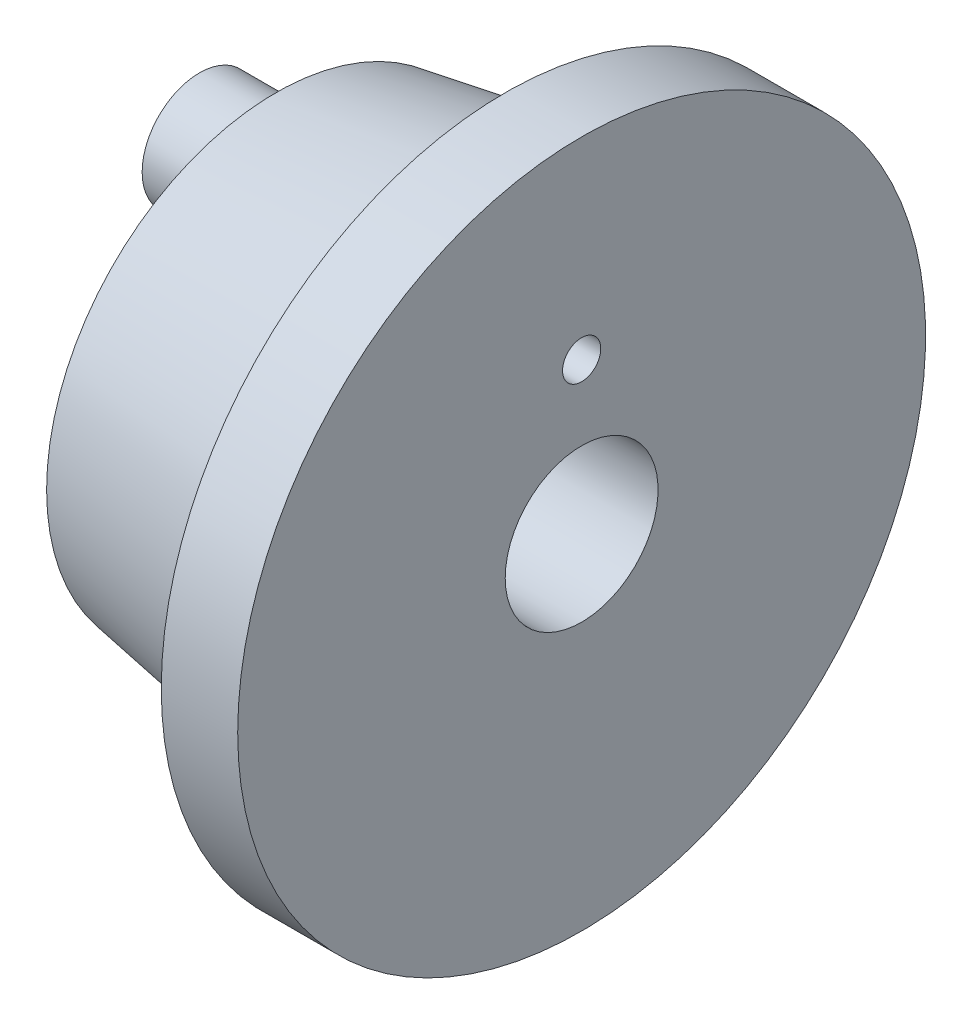
ISO-10303-21;
HEADER;
FILE_DESCRIPTION(('STEP AP214'),'2;1');
FILE_NAME('part.step','',(''),(''),'','','');
FILE_SCHEMA(('AUTOMOTIVE_DESIGN { 1 0 10303 214 1 1 1 1 }'));
ENDSEC;
DATA;
#1=APPLICATION_CONTEXT('core data for automotive mechanical design processes');
#2=APPLICATION_PROTOCOL_DEFINITION('international standard','automotive_design',2000,#1);
#3=PRODUCT_CONTEXT('',#1,'mechanical');
#4=PRODUCT('Part','Part','',(#3));
#5=PRODUCT_RELATED_PRODUCT_CATEGORY('part','',(#4));
#6=PRODUCT_DEFINITION_FORMATION('','',#4);
#7=PRODUCT_DEFINITION_CONTEXT('part definition',#1,'design');
#8=PRODUCT_DEFINITION('design','',#6,#7);
#9=PRODUCT_DEFINITION_SHAPE('','',#8);
#10=(LENGTH_UNIT() NAMED_UNIT(*) SI_UNIT(.MILLI.,.METRE.));
#11=(NAMED_UNIT(*) PLANE_ANGLE_UNIT() SI_UNIT($,.RADIAN.));
#12=(NAMED_UNIT(*) SI_UNIT($,.STERADIAN.) SOLID_ANGLE_UNIT());
#13=UNCERTAINTY_MEASURE_WITH_UNIT(LENGTH_MEASURE(1.E-05),#10,'distance_accuracy_value','');
#14=(GEOMETRIC_REPRESENTATION_CONTEXT(3) GLOBAL_UNCERTAINTY_ASSIGNED_CONTEXT((#13)) GLOBAL_UNIT_ASSIGNED_CONTEXT((#10,
#11,#12)) REPRESENTATION_CONTEXT('',''));
#15=CARTESIAN_POINT('',(0.,0.,0.));
#16=DIRECTION('',(0.,0.,1.));
#17=DIRECTION('',(1.,0.,0.));
#18=AXIS2_PLACEMENT_3D('',#15,#16,#17);
#19=CARTESIAN_POINT('',(-2.07252857729477,1.,0.));
#20=DIRECTION('',(1.,0.,0.));
#21=DIRECTION('',(0.,0.,-1.));
#22=AXIS2_PLACEMENT_3D('',#19,#20,#21);
#23=PLANE('',#22);
#24=CARTESIAN_POINT('',(-2.07252857729477,0.,0.));
#25=DIRECTION('',(-1.,0.,0.));
#26=DIRECTION('',(0.,0.,1.));
#27=AXIS2_PLACEMENT_3D('',#24,#25,#26);
#28=CIRCLE('',#27,3.);
#29=CARTESIAN_POINT('',(-2.07252857729477,0.,3.));
#30=VERTEX_POINT('',#29);
#31=EDGE_CURVE('E49',#30,#30,#28,.T.);
#32=ORIENTED_EDGE('',*,*,#31,.T.);
#33=EDGE_LOOP('',(#32));
#34=FACE_BOUND('',#33,.T.);
#35=CARTESIAN_POINT('',(-2.07252857729477,0.,0.));
#36=DIRECTION('',(-1.,0.,0.));
#37=DIRECTION('',(0.,0.,1.));
#38=AXIS2_PLACEMENT_3D('',#35,#36,#37);
#39=CIRCLE('',#38,1.);
#40=CARTESIAN_POINT('',(-2.07252857729477,0.,1.));
#41=VERTEX_POINT('',#40);
#42=EDGE_CURVE('E53',#41,#41,#39,.T.);
#43=ORIENTED_EDGE('',*,*,#42,.F.);
#44=EDGE_LOOP('',(#43));
#45=FACE_BOUND('',#44,.T.);
#46=CARTESIAN_POINT('',(-2.07252857729477,1.97451576137754,0.));
#47=DIRECTION('',(1.,0.,0.));
#48=DIRECTION('',(0.,0.,-1.));
#49=AXIS2_PLACEMENT_3D('',#46,#47,#48);
#50=CIRCLE('',#49,0.75);
#51=CARTESIAN_POINT('',(-2.07252857729477,1.97451576137754,-0.75));
#52=VERTEX_POINT('',#51);
#53=EDGE_CURVE('E10',#52,#52,#50,.F.);
#54=ORIENTED_EDGE('',*,*,#53,.F.);
#55=EDGE_LOOP('',(#54));
#56=FACE_BOUND('',#55,.T.);
#57=ADVANCED_FACE('F38',(#34,#45,#56),#23,.F.);
#58=CARTESIAN_POINT('',(0.927471422705227,4.5,0.));
#59=DIRECTION('',(1.,0.,0.));
#60=DIRECTION('',(0.,0.,-1.));
#61=AXIS2_PLACEMENT_3D('',#58,#59,#60);
#62=PLANE('',#61);
#63=CARTESIAN_POINT('',(0.927471422705228,0.,0.));
#64=DIRECTION('',(-1.,0.,0.));
#65=DIRECTION('',(0.,0.,1.));
#66=AXIS2_PLACEMENT_3D('',#63,#64,#65);
#67=CIRCLE('',#66,3.5);
#68=CARTESIAN_POINT('',(0.927471422705228,0.,3.5));
#69=VERTEX_POINT('',#68);
#70=EDGE_CURVE('E45',#69,#69,#67,.T.);
#71=ORIENTED_EDGE('',*,*,#70,.F.);
#72=EDGE_LOOP('',(#71));
#73=FACE_BOUND('',#72,.T.);
#74=CARTESIAN_POINT('',(0.927471422705226,0.,0.));
#75=DIRECTION('',(-1.,0.,0.));
#76=DIRECTION('',(0.,0.,1.));
#77=AXIS2_PLACEMENT_3D('',#74,#75,#76);
#78=CIRCLE('',#77,4.5);
#79=CARTESIAN_POINT('',(0.927471422705226,0.,4.5));
#80=VERTEX_POINT('',#79);
#81=EDGE_CURVE('E64',#80,#80,#78,.T.);
#82=ORIENTED_EDGE('',*,*,#81,.T.);
#83=EDGE_LOOP('',(#82));
#84=FACE_BOUND('',#83,.T.);
#85=ADVANCED_FACE('F40',(#73,#84),#62,.F.);
#86=CARTESIAN_POINT('',(0.927471422705228,0.,0.));
#87=DIRECTION('',(1.,0.,0.));
#88=DIRECTION('',(0.,0.,-1.));
#89=AXIS2_PLACEMENT_3D('',#86,#87,#88);
#90=CONICAL_SURFACE('',#89,3.5,0.165148677414627);
#91=ORIENTED_EDGE('',*,*,#31,.F.);
#92=EDGE_LOOP('',(#91));
#93=FACE_BOUND('',#92,.T.);
#94=ORIENTED_EDGE('',*,*,#70,.T.);
#95=EDGE_LOOP('',(#94));
#96=FACE_BOUND('',#95,.T.);
#97=ADVANCED_FACE('F99',(#93,#96),#90,.T.);
#98=CARTESIAN_POINT('',(-11.4711893790993,0.,0.));
#99=DIRECTION('',(-1.,0.,0.));
#100=DIRECTION('',(0.,0.,1.));
#101=AXIS2_PLACEMENT_3D('',#98,#99,#100);
#102=CYLINDRICAL_SURFACE('',#101,1.);
#103=CARTESIAN_POINT('',(1.92747142270523,0.,0.));
#104=DIRECTION('',(-1.,0.,0.));
#105=DIRECTION('',(0.,0.,1.));
#106=AXIS2_PLACEMENT_3D('',#103,#104,#105);
#107=CIRCLE('',#106,1.);
#108=CARTESIAN_POINT('',(1.92747142270523,0.,1.));
#109=VERTEX_POINT('',#108);
#110=EDGE_CURVE('E58',#109,#109,#107,.T.);
#111=ORIENTED_EDGE('',*,*,#110,.F.);
#112=EDGE_LOOP('',(#111));
#113=FACE_BOUND('',#112,.T.);
#114=ORIENTED_EDGE('',*,*,#42,.T.);
#115=EDGE_LOOP('',(#114));
#116=FACE_BOUND('',#115,.T.);
#117=ADVANCED_FACE('F103',(#113,#116),#102,.F.);
#118=CARTESIAN_POINT('',(1.92747142270523,4.5,0.));
#119=DIRECTION('',(-1.,0.,0.));
#120=DIRECTION('',(0.,0.,1.));
#121=AXIS2_PLACEMENT_3D('',#118,#119,#120);
#122=PLANE('',#121);
#123=CARTESIAN_POINT('',(1.92747142270523,1.97451576137754,0.));
#124=DIRECTION('',(-1.,0.,0.));
#125=DIRECTION('',(0.,0.,1.));
#126=AXIS2_PLACEMENT_3D('',#123,#124,#125);
#127=CIRCLE('',#126,0.25);
#128=CARTESIAN_POINT('',(1.92747142270523,1.97451576137754,0.25));
#129=VERTEX_POINT('',#128);
#130=EDGE_CURVE('E67',#129,#129,#127,.F.);
#131=ORIENTED_EDGE('',*,*,#130,.F.);
#132=EDGE_LOOP('',(#131));
#133=FACE_BOUND('',#132,.T.);
#134=CARTESIAN_POINT('',(1.92747142270523,0.,0.));
#135=DIRECTION('',(-1.,0.,0.));
#136=DIRECTION('',(0.,0.,1.));
#137=AXIS2_PLACEMENT_3D('',#134,#135,#136);
#138=CIRCLE('',#137,4.5);
#139=CARTESIAN_POINT('',(1.92747142270523,0.,4.5));
#140=VERTEX_POINT('',#139);
#141=EDGE_CURVE('E61',#140,#140,#138,.T.);
#142=ORIENTED_EDGE('',*,*,#141,.F.);
#143=EDGE_LOOP('',(#142));
#144=FACE_BOUND('',#143,.T.);
#145=ORIENTED_EDGE('',*,*,#110,.T.);
#146=EDGE_LOOP('',(#145));
#147=FACE_BOUND('',#146,.T.);
#148=ADVANCED_FACE('F110',(#133,#144,#147),#122,.F.);
#149=CARTESIAN_POINT('',(-11.4711893790993,0.,0.));
#150=DIRECTION('',(-1.,0.,0.));
#151=DIRECTION('',(0.,0.,1.));
#152=AXIS2_PLACEMENT_3D('',#149,#150,#151);
#153=CYLINDRICAL_SURFACE('',#152,4.5);
#154=ORIENTED_EDGE('',*,*,#81,.F.);
#155=EDGE_LOOP('',(#154));
#156=FACE_BOUND('',#155,.T.);
#157=ORIENTED_EDGE('',*,*,#141,.T.);
#158=EDGE_LOOP('',(#157));
#159=FACE_BOUND('',#158,.T.);
#160=ADVANCED_FACE('F90',(#156,#159),#153,.T.);
#161=CARTESIAN_POINT('',(2.63457820389177,1.97451576137754,0.));
#162=DIRECTION('',(-1.,0.,0.));
#163=DIRECTION('',(0.,0.,1.));
#164=AXIS2_PLACEMENT_3D('',#161,#162,#163);
#165=CYLINDRICAL_SURFACE('',#164,0.25);
#166=ORIENTED_EDGE('',*,*,#130,.T.);
#167=EDGE_LOOP('',(#166));
#168=FACE_BOUND('',#167,.T.);
#169=CARTESIAN_POINT('',(-3.07252857729477,1.97451576137754,0.));
#170=DIRECTION('',(-1.,0.,0.));
#171=DIRECTION('',(0.,0.,1.));
#172=AXIS2_PLACEMENT_3D('',#169,#170,#171);
#173=CIRCLE('',#172,0.25);
#174=CARTESIAN_POINT('',(-3.07252857729477,1.97451576137754,0.25));
#175=VERTEX_POINT('',#174);
#176=EDGE_CURVE('E73',#175,#175,#173,.T.);
#177=ORIENTED_EDGE('',*,*,#176,.T.);
#178=EDGE_LOOP('',(#177));
#179=FACE_BOUND('',#178,.T.);
#180=ADVANCED_FACE('F77',(#168,#179),#165,.F.);
#181=CARTESIAN_POINT('',(-3.07252857729477,1.97451576137754,0.));
#182=DIRECTION('',(-1.,0.,0.));
#183=DIRECTION('',(0.,0.,1.));
#184=AXIS2_PLACEMENT_3D('',#181,#182,#183);
#185=PLANE('',#184);
#186=CARTESIAN_POINT('',(-3.07252857729477,1.97451576137754,0.));
#187=DIRECTION('',(-1.,0.,0.));
#188=DIRECTION('',(0.,0.,1.));
#189=AXIS2_PLACEMENT_3D('',#186,#187,#188);
#190=CIRCLE('',#189,0.75);
#191=CARTESIAN_POINT('',(-3.07252857729477,1.97451576137754,0.75));
#192=VERTEX_POINT('',#191);
#193=EDGE_CURVE('E70',#192,#192,#190,.T.);
#194=ORIENTED_EDGE('',*,*,#193,.T.);
#195=EDGE_LOOP('',(#194));
#196=FACE_BOUND('',#195,.T.);
#197=ORIENTED_EDGE('',*,*,#176,.F.);
#198=EDGE_LOOP('',(#197));
#199=FACE_BOUND('',#198,.T.);
#200=ADVANCED_FACE('F79',(#196,#199),#185,.T.);
#201=CARTESIAN_POINT('',(-3.07252857729477,1.97451576137754,0.));
#202=DIRECTION('',(1.,0.,0.));
#203=DIRECTION('',(0.,0.,-1.));
#204=AXIS2_PLACEMENT_3D('',#201,#202,#203);
#205=CYLINDRICAL_SURFACE('',#204,0.75);
#206=ORIENTED_EDGE('',*,*,#193,.F.);
#207=EDGE_LOOP('',(#206));
#208=FACE_BOUND('',#207,.T.);
#209=ORIENTED_EDGE('',*,*,#53,.T.);
#210=EDGE_LOOP('',(#209));
#211=FACE_BOUND('',#210,.T.);
#212=ADVANCED_FACE('F81',(#208,#211),#205,.T.);
#213=CLOSED_SHELL('',(#57,#85,#97,#117,#148,#160,#180,#200,#212));
#214=MANIFOLD_SOLID_BREP('B2',#213);
#215=ADVANCED_BREP_SHAPE_REPRESENTATION('',(#18,#214),#14);
#216=SHAPE_DEFINITION_REPRESENTATION(#9,#215);
ENDSEC;
END-ISO-10303-21;
